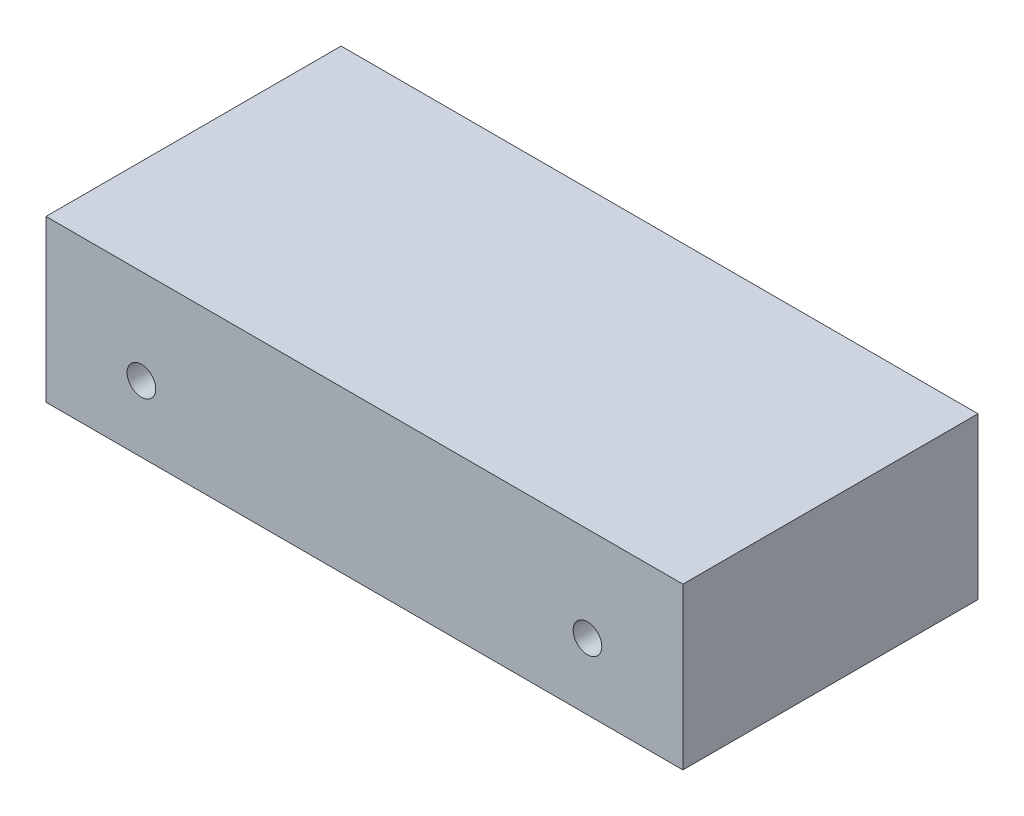
ISO-10303-21;
HEADER;
FILE_DESCRIPTION(('STEP AP214'),'2;1');
FILE_NAME('part.step','',(''),(''),'','','');
FILE_SCHEMA(('AUTOMOTIVE_DESIGN { 1 0 10303 214 1 1 1 1 }'));
ENDSEC;
DATA;
#1=APPLICATION_CONTEXT('core data for automotive mechanical design processes');
#2=APPLICATION_PROTOCOL_DEFINITION('international standard','automotive_design',2000,#1);
#3=PRODUCT_CONTEXT('',#1,'mechanical');
#4=PRODUCT('Part','Part','',(#3));
#5=PRODUCT_RELATED_PRODUCT_CATEGORY('part','',(#4));
#6=PRODUCT_DEFINITION_FORMATION('','',#4);
#7=PRODUCT_DEFINITION_CONTEXT('part definition',#1,'design');
#8=PRODUCT_DEFINITION('design','',#6,#7);
#9=PRODUCT_DEFINITION_SHAPE('','',#8);
#10=(LENGTH_UNIT() NAMED_UNIT(*) SI_UNIT(.MILLI.,.METRE.));
#11=(NAMED_UNIT(*) PLANE_ANGLE_UNIT() SI_UNIT($,.RADIAN.));
#12=(NAMED_UNIT(*) SI_UNIT($,.STERADIAN.) SOLID_ANGLE_UNIT());
#13=UNCERTAINTY_MEASURE_WITH_UNIT(LENGTH_MEASURE(1.E-05),#10,'distance_accuracy_value','');
#14=(GEOMETRIC_REPRESENTATION_CONTEXT(3) GLOBAL_UNCERTAINTY_ASSIGNED_CONTEXT((#13)) GLOBAL_UNIT_ASSIGNED_CONTEXT((#10,
#11,#12)) REPRESENTATION_CONTEXT('',''));
#15=CARTESIAN_POINT('',(0.,0.,0.));
#16=DIRECTION('',(0.,0.,1.));
#17=DIRECTION('',(1.,0.,0.));
#18=AXIS2_PLACEMENT_3D('',#15,#16,#17);
#19=CARTESIAN_POINT('',(155.321,39.243,143.9418));
#20=DIRECTION('',(-1.,0.,0.));
#21=DIRECTION('',(0.,-1.,0.));
#22=AXIS2_PLACEMENT_3D('',#19,#20,#21);
#23=PLANE('',#22);
#24=DIRECTION('',(0.,1.,0.));
#25=VECTOR('',#24,1.);
#26=CARTESIAN_POINT('',(155.321,39.243,0.));
#27=LINE('',#26,#25);
#28=CARTESIAN_POINT('',(155.321,-39.243,0.));
#29=VERTEX_POINT('',#28);
#30=CARTESIAN_POINT('',(155.321,39.243,0.));
#31=VERTEX_POINT('',#30);
#32=EDGE_CURVE('E99',#29,#31,#27,.T.);
#33=ORIENTED_EDGE('',*,*,#32,.T.);
#34=DIRECTION('',(0.,0.,-1.));
#35=VECTOR('',#34,1.);
#36=CARTESIAN_POINT('',(155.321,39.243,143.9418));
#37=LINE('',#36,#35);
#38=CARTESIAN_POINT('',(155.321,39.243,143.9418));
#39=VERTEX_POINT('',#38);
#40=EDGE_CURVE('E11',#39,#31,#37,.T.);
#41=ORIENTED_EDGE('',*,*,#40,.F.);
#42=DIRECTION('',(0.,1.,0.));
#43=VECTOR('',#42,1.);
#44=CARTESIAN_POINT('',(155.321,39.243,143.9418));
#45=LINE('',#44,#43);
#46=CARTESIAN_POINT('',(155.321,-39.243,143.9418));
#47=VERTEX_POINT('',#46);
#48=EDGE_CURVE('E87',#47,#39,#45,.T.);
#49=ORIENTED_EDGE('',*,*,#48,.F.);
#50=DIRECTION('',(0.,0.,-1.));
#51=VECTOR('',#50,1.);
#52=CARTESIAN_POINT('',(155.321,-39.243,143.9418));
#53=LINE('',#52,#51);
#54=EDGE_CURVE('E95',#47,#29,#53,.T.);
#55=ORIENTED_EDGE('',*,*,#54,.T.);
#56=EDGE_LOOP('',(#33,#41,#49,#55));
#57=FACE_BOUND('',#56,.T.);
#58=ADVANCED_FACE('F36',(#57),#23,.F.);
#59=CARTESIAN_POINT('',(-155.321,39.243,143.9418));
#60=DIRECTION('',(0.,-1.,0.));
#61=DIRECTION('',(0.,0.,-1.));
#62=AXIS2_PLACEMENT_3D('',#59,#60,#61);
#63=PLANE('',#62);
#64=DIRECTION('',(-1.,0.,0.));
#65=VECTOR('',#64,1.);
#66=CARTESIAN_POINT('',(-155.321,39.243,0.));
#67=LINE('',#66,#65);
#68=CARTESIAN_POINT('',(-155.321,39.243,0.));
#69=VERTEX_POINT('',#68);
#70=EDGE_CURVE('E91',#31,#69,#67,.T.);
#71=ORIENTED_EDGE('',*,*,#70,.T.);
#72=DIRECTION('',(0.,0.,-1.));
#73=VECTOR('',#72,1.);
#74=CARTESIAN_POINT('',(-155.321,39.243,143.9418));
#75=LINE('',#74,#73);
#76=CARTESIAN_POINT('',(-155.321,39.243,143.9418));
#77=VERTEX_POINT('',#76);
#78=EDGE_CURVE('E44',#77,#69,#75,.T.);
#79=ORIENTED_EDGE('',*,*,#78,.F.);
#80=DIRECTION('',(-1.,0.,0.));
#81=VECTOR('',#80,1.);
#82=CARTESIAN_POINT('',(-155.321,39.243,143.9418));
#83=LINE('',#82,#81);
#84=EDGE_CURVE('E82',#39,#77,#83,.T.);
#85=ORIENTED_EDGE('',*,*,#84,.F.);
#86=ORIENTED_EDGE('',*,*,#40,.T.);
#87=EDGE_LOOP('',(#71,#79,#85,#86));
#88=FACE_BOUND('',#87,.T.);
#89=ADVANCED_FACE('F90',(#88),#63,.F.);
#90=CARTESIAN_POINT('',(-155.321,39.243,143.9418));
#91=DIRECTION('',(1.,0.,0.));
#92=DIRECTION('',(0.,0.,-1.));
#93=AXIS2_PLACEMENT_3D('',#90,#91,#92);
#94=PLANE('',#93);
#95=DIRECTION('',(0.,-1.,0.));
#96=VECTOR('',#95,1.);
#97=CARTESIAN_POINT('',(-155.321,39.243,0.));
#98=LINE('',#97,#96);
#99=CARTESIAN_POINT('',(-155.321,-39.243,0.));
#100=VERTEX_POINT('',#99);
#101=EDGE_CURVE('E69',#69,#100,#98,.T.);
#102=ORIENTED_EDGE('',*,*,#101,.T.);
#103=DIRECTION('',(0.,0.,-1.));
#104=VECTOR('',#103,1.);
#105=CARTESIAN_POINT('',(-155.321,-39.243,143.9418));
#106=LINE('',#105,#104);
#107=CARTESIAN_POINT('',(-155.321,-39.243,143.9418));
#108=VERTEX_POINT('',#107);
#109=EDGE_CURVE('E92',#108,#100,#106,.T.);
#110=ORIENTED_EDGE('',*,*,#109,.F.);
#111=DIRECTION('',(0.,-1.,0.));
#112=VECTOR('',#111,1.);
#113=CARTESIAN_POINT('',(-155.321,39.243,143.9418));
#114=LINE('',#113,#112);
#115=EDGE_CURVE('E85',#77,#108,#114,.T.);
#116=ORIENTED_EDGE('',*,*,#115,.F.);
#117=ORIENTED_EDGE('',*,*,#78,.T.);
#118=EDGE_LOOP('',(#102,#110,#116,#117));
#119=FACE_BOUND('',#118,.T.);
#120=ADVANCED_FACE('F93',(#119),#94,.F.);
#121=CARTESIAN_POINT('',(-155.321,-39.243,143.9418));
#122=DIRECTION('',(0.,1.,0.));
#123=DIRECTION('',(0.,0.,1.));
#124=AXIS2_PLACEMENT_3D('',#121,#122,#123);
#125=PLANE('',#124);
#126=DIRECTION('',(1.,0.,0.));
#127=VECTOR('',#126,1.);
#128=CARTESIAN_POINT('',(-155.321,-39.243,0.));
#129=LINE('',#128,#127);
#130=EDGE_CURVE('E75',#100,#29,#129,.T.);
#131=ORIENTED_EDGE('',*,*,#130,.T.);
#132=ORIENTED_EDGE('',*,*,#54,.F.);
#133=DIRECTION('',(1.,0.,0.));
#134=VECTOR('',#133,1.);
#135=CARTESIAN_POINT('',(-155.321,-39.243,143.9418));
#136=LINE('',#135,#134);
#137=EDGE_CURVE('E52',#108,#47,#136,.T.);
#138=ORIENTED_EDGE('',*,*,#137,.F.);
#139=ORIENTED_EDGE('',*,*,#109,.T.);
#140=EDGE_LOOP('',(#131,#132,#138,#139));
#141=FACE_BOUND('',#140,.T.);
#142=ADVANCED_FACE('F107',(#141),#125,.F.);
#143=CARTESIAN_POINT('',(0.,0.,143.9418));
#144=DIRECTION('',(0.,0.,1.));
#145=DIRECTION('',(1.,0.,0.));
#146=AXIS2_PLACEMENT_3D('',#143,#144,#145);
#147=PLANE('',#146);
#148=CARTESIAN_POINT('',(-108.7882,-6.8834,143.9418));
#149=DIRECTION('',(0.,0.,1.));
#150=DIRECTION('',(1.,0.,0.));
#151=AXIS2_PLACEMENT_3D('',#148,#149,#150);
#152=CIRCLE('',#151,6.985);
#153=CARTESIAN_POINT('',(-101.8032,-6.8834,143.9418));
#154=VERTEX_POINT('',#153);
#155=EDGE_CURVE('E119',#154,#154,#152,.T.);
#156=ORIENTED_EDGE('',*,*,#155,.F.);
#157=EDGE_LOOP('',(#156));
#158=FACE_BOUND('',#157,.T.);
#159=CARTESIAN_POINT('',(108.7882,-6.8834,143.9418));
#160=DIRECTION('',(0.,0.,1.));
#161=DIRECTION('',(1.,0.,0.));
#162=AXIS2_PLACEMENT_3D('',#159,#160,#161);
#163=CIRCLE('',#162,6.98500000000001);
#164=CARTESIAN_POINT('',(115.7732,-6.8834,143.9418));
#165=VERTEX_POINT('',#164);
#166=EDGE_CURVE('E113',#165,#165,#163,.T.);
#167=ORIENTED_EDGE('',*,*,#166,.F.);
#168=EDGE_LOOP('',(#167));
#169=FACE_BOUND('',#168,.T.);
#170=ORIENTED_EDGE('',*,*,#48,.T.);
#171=ORIENTED_EDGE('',*,*,#84,.T.);
#172=ORIENTED_EDGE('',*,*,#115,.T.);
#173=ORIENTED_EDGE('',*,*,#137,.T.);
#174=EDGE_LOOP('',(#170,#171,#172,#173));
#175=FACE_BOUND('',#174,.T.);
#176=ADVANCED_FACE('F83',(#158,#169,#175),#147,.T.);
#177=CARTESIAN_POINT('',(0.,0.,0.));
#178=DIRECTION('',(0.,0.,1.));
#179=DIRECTION('',(1.,0.,0.));
#180=AXIS2_PLACEMENT_3D('',#177,#178,#179);
#181=PLANE('',#180);
#182=ORIENTED_EDGE('',*,*,#32,.F.);
#183=ORIENTED_EDGE('',*,*,#130,.F.);
#184=ORIENTED_EDGE('',*,*,#101,.F.);
#185=ORIENTED_EDGE('',*,*,#70,.F.);
#186=EDGE_LOOP('',(#182,#183,#184,#185));
#187=FACE_BOUND('',#186,.T.);
#188=ADVANCED_FACE('F110',(#187),#181,.F.);
#189=CARTESIAN_POINT('',(108.7882,-6.8834,118.5418));
#190=DIRECTION('',(0.,0.,1.));
#191=DIRECTION('',(1.,0.,0.));
#192=AXIS2_PLACEMENT_3D('',#189,#190,#191);
#193=CYLINDRICAL_SURFACE('',#192,6.98500000000001);
#194=CARTESIAN_POINT('',(108.7882,-6.8834,118.5418));
#195=DIRECTION('',(0.,0.,1.));
#196=DIRECTION('',(1.,0.,0.));
#197=AXIS2_PLACEMENT_3D('',#194,#195,#196);
#198=CIRCLE('',#197,6.98500000000001);
#199=CARTESIAN_POINT('',(115.7732,-6.8834,118.5418));
#200=VERTEX_POINT('',#199);
#201=EDGE_CURVE('E116',#200,#200,#198,.T.);
#202=ORIENTED_EDGE('',*,*,#201,.F.);
#203=EDGE_LOOP('',(#202));
#204=FACE_BOUND('',#203,.T.);
#205=ORIENTED_EDGE('',*,*,#166,.T.);
#206=EDGE_LOOP('',(#205));
#207=FACE_BOUND('',#206,.T.);
#208=ADVANCED_FACE('F139',(#204,#207),#193,.F.);
#209=CARTESIAN_POINT('',(108.7882,-6.8834,118.5418));
#210=DIRECTION('',(0.,0.,1.));
#211=DIRECTION('',(1.,0.,0.));
#212=AXIS2_PLACEMENT_3D('',#209,#210,#211);
#213=PLANE('',#212);
#214=ORIENTED_EDGE('',*,*,#201,.T.);
#215=EDGE_LOOP('',(#214));
#216=FACE_BOUND('',#215,.T.);
#217=ADVANCED_FACE('F130',(#216),#213,.T.);
#218=CARTESIAN_POINT('',(-108.7882,-6.8834,118.5418));
#219=DIRECTION('',(0.,0.,1.));
#220=DIRECTION('',(1.,0.,0.));
#221=AXIS2_PLACEMENT_3D('',#218,#219,#220);
#222=CYLINDRICAL_SURFACE('',#221,6.985);
#223=CARTESIAN_POINT('',(-108.7882,-6.8834,118.5418));
#224=DIRECTION('',(0.,0.,1.));
#225=DIRECTION('',(1.,0.,0.));
#226=AXIS2_PLACEMENT_3D('',#223,#224,#225);
#227=CIRCLE('',#226,6.985);
#228=CARTESIAN_POINT('',(-101.8032,-6.8834,118.5418));
#229=VERTEX_POINT('',#228);
#230=EDGE_CURVE('E102',#229,#229,#227,.T.);
#231=ORIENTED_EDGE('',*,*,#230,.F.);
#232=EDGE_LOOP('',(#231));
#233=FACE_BOUND('',#232,.T.);
#234=ORIENTED_EDGE('',*,*,#155,.T.);
#235=EDGE_LOOP('',(#234));
#236=FACE_BOUND('',#235,.T.);
#237=ADVANCED_FACE('F127',(#233,#236),#222,.F.);
#238=CARTESIAN_POINT('',(-108.7882,-6.8834,118.5418));
#239=DIRECTION('',(0.,0.,1.));
#240=DIRECTION('',(1.,0.,0.));
#241=AXIS2_PLACEMENT_3D('',#238,#239,#240);
#242=PLANE('',#241);
#243=ORIENTED_EDGE('',*,*,#230,.T.);
#244=EDGE_LOOP('',(#243));
#245=FACE_BOUND('',#244,.T.);
#246=ADVANCED_FACE('F125',(#245),#242,.T.);
#247=CLOSED_SHELL('',(#58,#89,#120,#142,#176,#188,#208,#217,#237,#246));
#248=MANIFOLD_SOLID_BREP('B2',#247);
#249=ADVANCED_BREP_SHAPE_REPRESENTATION('',(#18,#248),#14);
#250=SHAPE_DEFINITION_REPRESENTATION(#9,#249);
ENDSEC;
END-ISO-10303-21;
